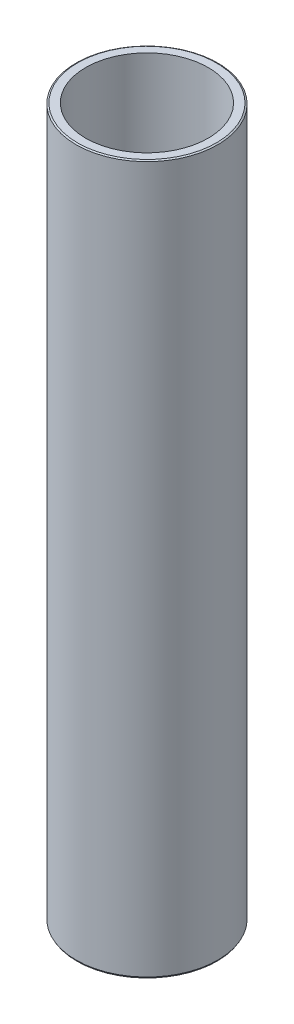
ISO-10303-21;
HEADER;
FILE_DESCRIPTION(('STEP AP214'),'2;1');
FILE_NAME('part.step','',(''),(''),'','','');
FILE_SCHEMA(('AUTOMOTIVE_DESIGN { 1 0 10303 214 1 1 1 1 }'));
ENDSEC;
DATA;
#1=APPLICATION_CONTEXT('core data for automotive mechanical design processes');
#2=APPLICATION_PROTOCOL_DEFINITION('international standard','automotive_design',2000,#1);
#3=PRODUCT_CONTEXT('',#1,'mechanical');
#4=PRODUCT('Part','Part','',(#3));
#5=PRODUCT_RELATED_PRODUCT_CATEGORY('part','',(#4));
#6=PRODUCT_DEFINITION_FORMATION('','',#4);
#7=PRODUCT_DEFINITION_CONTEXT('part definition',#1,'design');
#8=PRODUCT_DEFINITION('design','',#6,#7);
#9=PRODUCT_DEFINITION_SHAPE('','',#8);
#10=(LENGTH_UNIT() NAMED_UNIT(*) SI_UNIT(.MILLI.,.METRE.));
#11=(NAMED_UNIT(*) PLANE_ANGLE_UNIT() SI_UNIT($,.RADIAN.));
#12=(NAMED_UNIT(*) SI_UNIT($,.STERADIAN.) SOLID_ANGLE_UNIT());
#13=UNCERTAINTY_MEASURE_WITH_UNIT(LENGTH_MEASURE(1.E-05),#10,'distance_accuracy_value','');
#14=(GEOMETRIC_REPRESENTATION_CONTEXT(3) GLOBAL_UNCERTAINTY_ASSIGNED_CONTEXT((#13)) GLOBAL_UNIT_ASSIGNED_CONTEXT((#10,
#11,#12)) REPRESENTATION_CONTEXT('',''));
#15=CARTESIAN_POINT('',(0.,0.,0.));
#16=DIRECTION('',(0.,0.,1.));
#17=DIRECTION('',(1.,0.,0.));
#18=AXIS2_PLACEMENT_3D('',#15,#16,#17);
#19=CARTESIAN_POINT('',(0.,600.,0.));
#20=DIRECTION('',(0.,-1.,0.));
#21=DIRECTION('',(0.,0.,-1.));
#22=AXIS2_PLACEMENT_3D('',#19,#20,#21);
#23=CYLINDRICAL_SURFACE('',#22,60.);
#24=CARTESIAN_POINT('',(0.,599.280255337724,0.));
#25=DIRECTION('',(0.,1.,0.));
#26=DIRECTION('',(0.,0.,1.));
#27=AXIS2_PLACEMENT_3D('',#24,#25,#26);
#28=CIRCLE('',#27,60.);
#29=CARTESIAN_POINT('',(0.,599.280255337724,60.));
#30=VERTEX_POINT('',#29);
#31=EDGE_CURVE('E50',#30,#30,#28,.F.);
#32=ORIENTED_EDGE('',*,*,#31,.T.);
#33=EDGE_LOOP('',(#32));
#34=FACE_BOUND('',#33,.T.);
#35=CARTESIAN_POINT('',(0.,1.24663432353866,0.));
#36=DIRECTION('',(0.,1.,0.));
#37=DIRECTION('',(0.,0.,1.));
#38=AXIS2_PLACEMENT_3D('',#35,#36,#37);
#39=CIRCLE('',#38,60.);
#40=CARTESIAN_POINT('',(0.,1.24663432353866,60.));
#41=VERTEX_POINT('',#40);
#42=EDGE_CURVE('E51',#41,#41,#39,.T.);
#43=ORIENTED_EDGE('',*,*,#42,.T.);
#44=EDGE_LOOP('',(#43));
#45=FACE_BOUND('',#44,.T.);
#46=ADVANCED_FACE('F39',(#34,#45),#23,.T.);
#47=CARTESIAN_POINT('',(0.,600.,0.));
#48=DIRECTION('',(0.,1.,0.));
#49=DIRECTION('',(0.,0.,1.));
#50=AXIS2_PLACEMENT_3D('',#47,#48,#49);
#51=PLANE('',#50);
#52=CARTESIAN_POINT('',(0.,600.,0.));
#53=DIRECTION('',(0.,1.,0.));
#54=DIRECTION('',(0.,0.,1.));
#55=AXIS2_PLACEMENT_3D('',#52,#53,#54);
#56=CIRCLE('',#55,58.7533656764612);
#57=CARTESIAN_POINT('',(0.,600.,58.7533656764612));
#58=VERTEX_POINT('',#57);
#59=EDGE_CURVE('E54',#58,#58,#56,.T.);
#60=ORIENTED_EDGE('',*,*,#59,.T.);
#61=EDGE_LOOP('',(#60));
#62=FACE_BOUND('',#61,.T.);
#63=CARTESIAN_POINT('',(0.,600.,0.));
#64=DIRECTION('',(0.,1.,0.));
#65=DIRECTION('',(0.,0.,1.));
#66=AXIS2_PLACEMENT_3D('',#63,#64,#65);
#67=CIRCLE('',#66,51.8925058102408);
#68=CARTESIAN_POINT('',(0.,600.,51.8925058102408));
#69=VERTEX_POINT('',#68);
#70=EDGE_CURVE('E58',#69,#69,#67,.T.);
#71=ORIENTED_EDGE('',*,*,#70,.F.);
#72=EDGE_LOOP('',(#71));
#73=FACE_BOUND('',#72,.T.);
#74=ADVANCED_FACE('F69',(#62,#73),#51,.T.);
#75=CARTESIAN_POINT('',(0.,0.,0.));
#76=DIRECTION('',(0.,1.,0.));
#77=DIRECTION('',(0.,0.,1.));
#78=AXIS2_PLACEMENT_3D('',#75,#76,#77);
#79=PLANE('',#78);
#80=CARTESIAN_POINT('',(0.,0.,0.));
#81=DIRECTION('',(0.,1.,0.));
#82=DIRECTION('',(0.,0.,1.));
#83=AXIS2_PLACEMENT_3D('',#80,#81,#82);
#84=CIRCLE('',#83,59.2802553377239);
#85=CARTESIAN_POINT('',(0.,0.,59.2802553377239));
#86=VERTEX_POINT('',#85);
#87=EDGE_CURVE('E10',#86,#86,#84,.F.);
#88=ORIENTED_EDGE('',*,*,#87,.T.);
#89=EDGE_LOOP('',(#88));
#90=FACE_BOUND('',#89,.T.);
#91=CARTESIAN_POINT('',(0.,0.,0.));
#92=DIRECTION('',(0.,1.,0.));
#93=DIRECTION('',(0.,0.,1.));
#94=AXIS2_PLACEMENT_3D('',#91,#92,#93);
#95=CIRCLE('',#94,51.8925058102408);
#96=CARTESIAN_POINT('',(0.,0.,51.8925058102408));
#97=VERTEX_POINT('',#96);
#98=EDGE_CURVE('E63',#97,#97,#95,.T.);
#99=ORIENTED_EDGE('',*,*,#98,.T.);
#100=EDGE_LOOP('',(#99));
#101=FACE_BOUND('',#100,.T.);
#102=ADVANCED_FACE('F75',(#90,#101),#79,.F.);
#103=CARTESIAN_POINT('',(0.,600.,0.));
#104=DIRECTION('',(0.,-1.,0.));
#105=DIRECTION('',(0.,0.,-1.));
#106=AXIS2_PLACEMENT_3D('',#103,#104,#105);
#107=CYLINDRICAL_SURFACE('',#106,51.8925058102408);
#108=ORIENTED_EDGE('',*,*,#70,.T.);
#109=EDGE_LOOP('',(#108));
#110=FACE_BOUND('',#109,.T.);
#111=ORIENTED_EDGE('',*,*,#98,.F.);
#112=EDGE_LOOP('',(#111));
#113=FACE_BOUND('',#112,.T.);
#114=ADVANCED_FACE('F70',(#110,#113),#107,.F.);
#115=CARTESIAN_POINT('',(0.,600.,0.));
#116=DIRECTION('',(0.,-1.,0.));
#117=DIRECTION('',(0.,0.,-1.));
#118=AXIS2_PLACEMENT_3D('',#115,#116,#117);
#119=CONICAL_SURFACE('',#118,58.7533656764612,1.04719755119664);
#120=ORIENTED_EDGE('',*,*,#31,.F.);
#121=EDGE_LOOP('',(#120));
#122=FACE_BOUND('',#121,.T.);
#123=ORIENTED_EDGE('',*,*,#59,.F.);
#124=EDGE_LOOP('',(#123));
#125=FACE_BOUND('',#124,.T.);
#126=ADVANCED_FACE('F81',(#122,#125),#119,.T.);
#127=CARTESIAN_POINT('',(0.,1.24663432353866,0.));
#128=DIRECTION('',(0.,1.,0.));
#129=DIRECTION('',(0.,0.,1.));
#130=AXIS2_PLACEMENT_3D('',#127,#128,#129);
#131=CONICAL_SURFACE('',#130,60.,0.523598775598308);
#132=ORIENTED_EDGE('',*,*,#87,.F.);
#133=EDGE_LOOP('',(#132));
#134=FACE_BOUND('',#133,.T.);
#135=ORIENTED_EDGE('',*,*,#42,.F.);
#136=EDGE_LOOP('',(#135));
#137=FACE_BOUND('',#136,.T.);
#138=ADVANCED_FACE('F45',(#134,#137),#131,.T.);
#139=CLOSED_SHELL('',(#46,#74,#102,#114,#126,#138));
#140=MANIFOLD_SOLID_BREP('B2',#139);
#141=ADVANCED_BREP_SHAPE_REPRESENTATION('',(#18,#140),#14);
#142=SHAPE_DEFINITION_REPRESENTATION(#9,#141);
ENDSEC;
END-ISO-10303-21;
